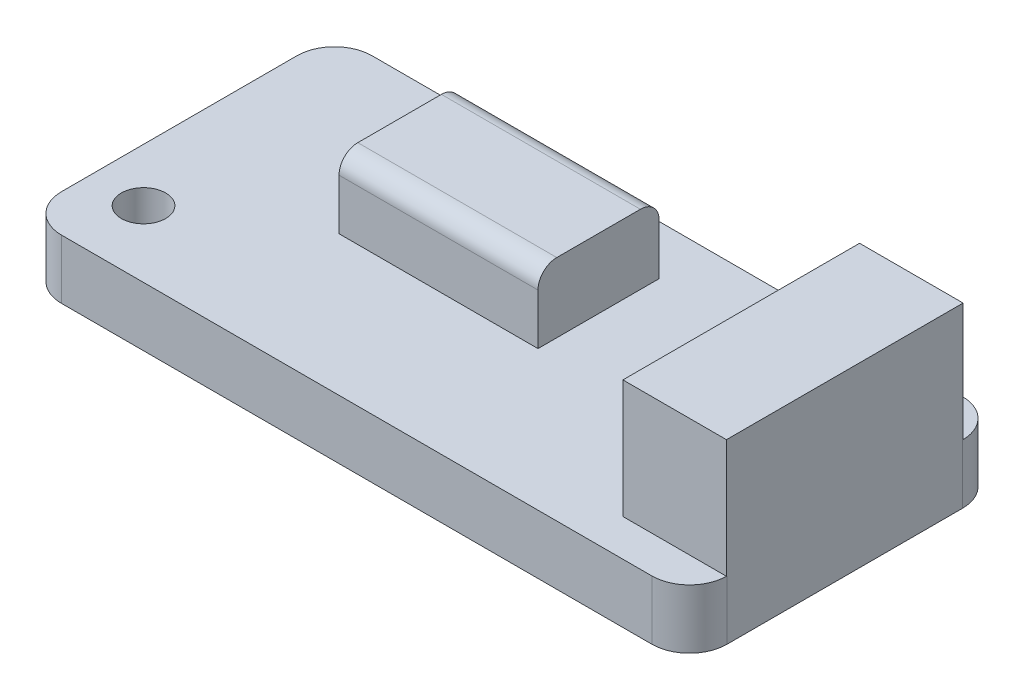
ISO-10303-21;
HEADER;
FILE_DESCRIPTION(('STEP AP214'),'2;1');
FILE_NAME('part.step','',(''),(''),'','','');
FILE_SCHEMA(('AUTOMOTIVE_DESIGN { 1 0 10303 214 1 1 1 1 }'));
ENDSEC;
DATA;
#1=APPLICATION_CONTEXT('core data for automotive mechanical design processes');
#2=APPLICATION_PROTOCOL_DEFINITION('international standard','automotive_design',2000,#1);
#3=PRODUCT_CONTEXT('',#1,'mechanical');
#4=PRODUCT('Part','Part','',(#3));
#5=PRODUCT_RELATED_PRODUCT_CATEGORY('part','',(#4));
#6=PRODUCT_DEFINITION_FORMATION('','',#4);
#7=PRODUCT_DEFINITION_CONTEXT('part definition',#1,'design');
#8=PRODUCT_DEFINITION('design','',#6,#7);
#9=PRODUCT_DEFINITION_SHAPE('','',#8);
#10=(LENGTH_UNIT() NAMED_UNIT(*) SI_UNIT(.MILLI.,.METRE.));
#11=(NAMED_UNIT(*) PLANE_ANGLE_UNIT() SI_UNIT($,.RADIAN.));
#12=(NAMED_UNIT(*) SI_UNIT($,.STERADIAN.) SOLID_ANGLE_UNIT());
#13=UNCERTAINTY_MEASURE_WITH_UNIT(LENGTH_MEASURE(1.E-05),#10,'distance_accuracy_value','');
#14=(GEOMETRIC_REPRESENTATION_CONTEXT(3) GLOBAL_UNCERTAINTY_ASSIGNED_CONTEXT((#13)) GLOBAL_UNIT_ASSIGNED_CONTEXT((#10,
#11,#12)) REPRESENTATION_CONTEXT('',''));
#15=CARTESIAN_POINT('',(0.,0.,0.));
#16=DIRECTION('',(0.,0.,1.));
#17=DIRECTION('',(1.,0.,0.));
#18=AXIS2_PLACEMENT_3D('',#15,#16,#17);
#19=CARTESIAN_POINT('',(19.96,4.,-7.96));
#20=DIRECTION('',(0.,-1.,0.));
#21=DIRECTION('',(0.,0.,-1.));
#22=AXIS2_PLACEMENT_3D('',#19,#20,#21);
#23=PLANE('',#22);
#24=CARTESIAN_POINT('',(-18.902,4.,6.01));
#25=DIRECTION('',(0.,1.,0.));
#26=DIRECTION('',(0.,0.,1.));
#27=AXIS2_PLACEMENT_3D('',#24,#25,#26);
#28=CIRCLE('',#27,1.5);
#29=CARTESIAN_POINT('',(-18.902,4.,7.51));
#30=VERTEX_POINT('',#29);
#31=EDGE_CURVE('E596',#30,#30,#28,.T.);
#32=ORIENTED_EDGE('',*,*,#31,.F.);
#33=EDGE_LOOP('',(#32));
#34=FACE_BOUND('',#33,.T.);
#35=CARTESIAN_POINT('',(10.308,4.,-6.69));
#36=DIRECTION('',(0.,1.,0.));
#37=DIRECTION('',(0.,0.,1.));
#38=AXIS2_PLACEMENT_3D('',#35,#36,#37);
#39=CIRCLE('',#38,1.5);
#40=CARTESIAN_POINT('',(10.308,4.,-5.19));
#41=VERTEX_POINT('',#40);
#42=EDGE_CURVE('E597',#41,#41,#39,.T.);
#43=ORIENTED_EDGE('',*,*,#42,.F.);
#44=EDGE_LOOP('',(#43));
#45=FACE_BOUND('',#44,.T.);
#46=DIRECTION('',(1.,0.,0.));
#47=VECTOR('',#46,1.);
#48=CARTESIAN_POINT('',(15.5,4.,7.99999999999999));
#49=LINE('',#48,#47);
#50=CARTESIAN_POINT('',(15.5,4.,7.99999999999999));
#51=VERTEX_POINT('',#50);
#52=CARTESIAN_POINT('',(22.4996850198401,4.,7.99999999999999));
#53=VERTEX_POINT('',#52);
#54=EDGE_CURVE('E214',#51,#53,#49,.T.);
#55=ORIENTED_EDGE('',*,*,#54,.F.);
#56=DIRECTION('',(0.,0.,1.));
#57=VECTOR('',#56,1.);
#58=CARTESIAN_POINT('',(15.5,4.,7.99999999999999));
#59=LINE('',#58,#57);
#60=CARTESIAN_POINT('',(15.5,4.,-8.00000000000001));
#61=VERTEX_POINT('',#60);
#62=EDGE_CURVE('E227',#61,#51,#59,.T.);
#63=ORIENTED_EDGE('',*,*,#62,.F.);
#64=DIRECTION('',(-1.,0.,0.));
#65=VECTOR('',#64,1.);
#66=CARTESIAN_POINT('',(15.5,4.,-8.00000000000001));
#67=LINE('',#66,#65);
#68=CARTESIAN_POINT('',(22.4996850198401,4.,-8.00000000000001));
#69=VERTEX_POINT('',#68);
#70=EDGE_CURVE('E228',#69,#61,#67,.T.);
#71=ORIENTED_EDGE('',*,*,#70,.F.);
#72=CARTESIAN_POINT('',(19.96,4.,-7.96));
#73=DIRECTION('',(0.,1.,0.));
#74=DIRECTION('',(0.,0.,-1.));
#75=AXIS2_PLACEMENT_3D('',#72,#73,#74);
#76=CIRCLE('',#75,2.54);
#77=CARTESIAN_POINT('',(19.96,4.,-10.5));
#78=VERTEX_POINT('',#77);
#79=EDGE_CURVE('E250',#69,#78,#76,.T.);
#80=ORIENTED_EDGE('',*,*,#79,.T.);
#81=DIRECTION('',(-1.,0.,0.));
#82=VECTOR('',#81,1.);
#83=CARTESIAN_POINT('',(-19.96,4.,-10.5));
#84=LINE('',#83,#82);
#85=CARTESIAN_POINT('',(-19.96,4.,-10.5));
#86=VERTEX_POINT('',#85);
#87=EDGE_CURVE('E249',#78,#86,#84,.T.);
#88=ORIENTED_EDGE('',*,*,#87,.T.);
#89=CARTESIAN_POINT('',(-19.96,4.,-7.96));
#90=DIRECTION('',(0.,1.,0.));
#91=DIRECTION('',(0.,0.,-1.));
#92=AXIS2_PLACEMENT_3D('',#89,#90,#91);
#93=CIRCLE('',#92,2.54);
#94=CARTESIAN_POINT('',(-22.5,4.,-7.95999999999998));
#95=VERTEX_POINT('',#94);
#96=EDGE_CURVE('E252',#86,#95,#93,.T.);
#97=ORIENTED_EDGE('',*,*,#96,.T.);
#98=DIRECTION('',(0.,0.,1.));
#99=VECTOR('',#98,1.);
#100=CARTESIAN_POINT('',(-22.5,4.,7.95999999999998));
#101=LINE('',#100,#99);
#102=CARTESIAN_POINT('',(-22.5,4.,7.95999999999998));
#103=VERTEX_POINT('',#102);
#104=EDGE_CURVE('E254',#95,#103,#101,.T.);
#105=ORIENTED_EDGE('',*,*,#104,.T.);
#106=CARTESIAN_POINT('',(-19.96,4.,7.96));
#107=DIRECTION('',(0.,1.,0.));
#108=DIRECTION('',(0.,0.,-1.));
#109=AXIS2_PLACEMENT_3D('',#106,#107,#108);
#110=CIRCLE('',#109,2.54);
#111=CARTESIAN_POINT('',(-19.96,4.,10.5));
#112=VERTEX_POINT('',#111);
#113=EDGE_CURVE('E256',#103,#112,#110,.T.);
#114=ORIENTED_EDGE('',*,*,#113,.T.);
#115=DIRECTION('',(1.,0.,0.));
#116=VECTOR('',#115,1.);
#117=CARTESIAN_POINT('',(-19.96,4.,10.5));
#118=LINE('',#117,#116);
#119=CARTESIAN_POINT('',(19.96,4.,10.5));
#120=VERTEX_POINT('',#119);
#121=EDGE_CURVE('E258',#112,#120,#118,.T.);
#122=ORIENTED_EDGE('',*,*,#121,.T.);
#123=CARTESIAN_POINT('',(19.96,4.,7.96));
#124=DIRECTION('',(0.,1.,0.));
#125=DIRECTION('',(0.,0.,1.));
#126=AXIS2_PLACEMENT_3D('',#123,#124,#125);
#127=CIRCLE('',#126,2.54);
#128=EDGE_CURVE('E261',#120,#53,#127,.T.);
#129=ORIENTED_EDGE('',*,*,#128,.T.);
#130=EDGE_LOOP('',(#55,#63,#71,#80,#88,#97,#105,#114,#122,#129));
#131=FACE_BOUND('',#130,.T.);
#132=DIRECTION('',(0.,0.,1.));
#133=VECTOR('',#132,1.);
#134=CARTESIAN_POINT('',(-10.654824169029,4.,-7.15417175194482));
#135=LINE('',#134,#133);
#136=CARTESIAN_POINT('',(-10.654824169029,4.,-7.15417175194482));
#137=VERTEX_POINT('',#136);
#138=CARTESIAN_POINT('',(-10.654824169029,4.,1.03949504088089));
#139=VERTEX_POINT('',#138);
#140=EDGE_CURVE('E179',#137,#139,#135,.T.);
#141=ORIENTED_EDGE('',*,*,#140,.F.);
#142=DIRECTION('',(-1.,0.,0.));
#143=VECTOR('',#142,1.);
#144=CARTESIAN_POINT('',(-10.654824169029,4.,-7.15417175194482));
#145=LINE('',#144,#143);
#146=CARTESIAN_POINT('',(2.79746459531176,4.,-7.15417175194482));
#147=VERTEX_POINT('',#146);
#148=EDGE_CURVE('E189',#147,#137,#145,.T.);
#149=ORIENTED_EDGE('',*,*,#148,.F.);
#150=DIRECTION('',(0.,0.,-1.));
#151=VECTOR('',#150,1.);
#152=CARTESIAN_POINT('',(2.79746459531176,4.,-7.15417175194482));
#153=LINE('',#152,#151);
#154=CARTESIAN_POINT('',(2.79746459531176,4.,1.03949504088089));
#155=VERTEX_POINT('',#154);
#156=EDGE_CURVE('E197',#155,#147,#153,.T.);
#157=ORIENTED_EDGE('',*,*,#156,.F.);
#158=DIRECTION('',(1.,0.,0.));
#159=VECTOR('',#158,1.);
#160=CARTESIAN_POINT('',(-10.654824169029,4.,1.03949504088089));
#161=LINE('',#160,#159);
#162=EDGE_CURVE('E192',#139,#155,#161,.T.);
#163=ORIENTED_EDGE('',*,*,#162,.F.);
#164=EDGE_LOOP('',(#141,#149,#157,#163));
#165=FACE_BOUND('',#164,.T.);
#166=ADVANCED_FACE('F44',(#34,#45,#131,#165),#23,.F.);
#167=CARTESIAN_POINT('',(19.96,4.,-7.96));
#168=DIRECTION('',(0.,-1.,0.));
#169=DIRECTION('',(0.,0.,-1.));
#170=AXIS2_PLACEMENT_3D('',#167,#168,#169);
#171=CYLINDRICAL_SURFACE('',#170,2.54);
#172=CARTESIAN_POINT('',(19.96,0.,-7.96));
#173=DIRECTION('',(0.,1.,0.));
#174=DIRECTION('',(0.,0.,-1.));
#175=AXIS2_PLACEMENT_3D('',#172,#173,#174);
#176=CIRCLE('',#175,2.54);
#177=CARTESIAN_POINT('',(22.5,0.,-7.95999999999998));
#178=VERTEX_POINT('',#177);
#179=CARTESIAN_POINT('',(19.96,0.,-10.5));
#180=VERTEX_POINT('',#179);
#181=EDGE_CURVE('E245',#178,#180,#176,.T.);
#182=ORIENTED_EDGE('',*,*,#181,.T.);
#183=DIRECTION('',(0.,-1.,0.));
#184=VECTOR('',#183,1.);
#185=CARTESIAN_POINT('',(19.96,4.,-10.5));
#186=LINE('',#185,#184);
#187=EDGE_CURVE('E301',#78,#180,#186,.T.);
#188=ORIENTED_EDGE('',*,*,#187,.F.);
#189=ORIENTED_EDGE('',*,*,#79,.F.);
#190=CARTESIAN_POINT('',(22.5,4.,-7.95999999999998));
#191=VERTEX_POINT('',#190);
#192=EDGE_CURVE('E246',#191,#69,#76,.T.);
#193=ORIENTED_EDGE('',*,*,#192,.F.);
#194=DIRECTION('',(0.,-1.,0.));
#195=VECTOR('',#194,1.);
#196=CARTESIAN_POINT('',(22.5,4.,-7.95999999999998));
#197=LINE('',#196,#195);
#198=EDGE_CURVE('E264',#191,#178,#197,.T.);
#199=ORIENTED_EDGE('',*,*,#198,.T.);
#200=EDGE_LOOP('',(#182,#188,#189,#193,#199));
#201=FACE_BOUND('',#200,.T.);
#202=ADVANCED_FACE('F334',(#201),#171,.T.);
#203=CARTESIAN_POINT('',(-19.96,4.,-10.5));
#204=DIRECTION('',(0.,0.,1.));
#205=DIRECTION('',(1.,0.,0.));
#206=AXIS2_PLACEMENT_3D('',#203,#204,#205);
#207=PLANE('',#206);
#208=DIRECTION('',(-1.,0.,0.));
#209=VECTOR('',#208,1.);
#210=CARTESIAN_POINT('',(-19.96,0.,-10.5));
#211=LINE('',#210,#209);
#212=CARTESIAN_POINT('',(-19.96,0.,-10.5));
#213=VERTEX_POINT('',#212);
#214=EDGE_CURVE('E267',#180,#213,#211,.T.);
#215=ORIENTED_EDGE('',*,*,#214,.T.);
#216=DIRECTION('',(0.,-1.,0.));
#217=VECTOR('',#216,1.);
#218=CARTESIAN_POINT('',(-19.96,4.,-10.5));
#219=LINE('',#218,#217);
#220=EDGE_CURVE('E298',#86,#213,#219,.T.);
#221=ORIENTED_EDGE('',*,*,#220,.F.);
#222=ORIENTED_EDGE('',*,*,#87,.F.);
#223=ORIENTED_EDGE('',*,*,#187,.T.);
#224=EDGE_LOOP('',(#215,#221,#222,#223));
#225=FACE_BOUND('',#224,.T.);
#226=ADVANCED_FACE('F341',(#225),#207,.F.);
#227=CARTESIAN_POINT('',(-19.96,4.,-7.96));
#228=DIRECTION('',(0.,-1.,0.));
#229=DIRECTION('',(0.,0.,-1.));
#230=AXIS2_PLACEMENT_3D('',#227,#228,#229);
#231=CYLINDRICAL_SURFACE('',#230,2.54);
#232=CARTESIAN_POINT('',(-19.96,0.,-7.96));
#233=DIRECTION('',(0.,1.,0.));
#234=DIRECTION('',(0.,0.,-1.));
#235=AXIS2_PLACEMENT_3D('',#232,#233,#234);
#236=CIRCLE('',#235,2.54);
#237=CARTESIAN_POINT('',(-22.5,0.,-7.95999999999998));
#238=VERTEX_POINT('',#237);
#239=EDGE_CURVE('E269',#213,#238,#236,.T.);
#240=ORIENTED_EDGE('',*,*,#239,.T.);
#241=DIRECTION('',(0.,-1.,0.));
#242=VECTOR('',#241,1.);
#243=CARTESIAN_POINT('',(-22.5,4.,-7.95999999999998));
#244=LINE('',#243,#242);
#245=EDGE_CURVE('E295',#95,#238,#244,.T.);
#246=ORIENTED_EDGE('',*,*,#245,.F.);
#247=ORIENTED_EDGE('',*,*,#96,.F.);
#248=ORIENTED_EDGE('',*,*,#220,.T.);
#249=EDGE_LOOP('',(#240,#246,#247,#248));
#250=FACE_BOUND('',#249,.T.);
#251=ADVANCED_FACE('F372',(#250),#231,.T.);
#252=CARTESIAN_POINT('',(-22.5,4.,7.95999999999998));
#253=DIRECTION('',(1.,0.,0.));
#254=DIRECTION('',(0.,0.,-1.));
#255=AXIS2_PLACEMENT_3D('',#252,#253,#254);
#256=PLANE('',#255);
#257=DIRECTION('',(0.,0.,1.));
#258=VECTOR('',#257,1.);
#259=CARTESIAN_POINT('',(-22.5,0.,7.95999999999998));
#260=LINE('',#259,#258);
#261=CARTESIAN_POINT('',(-22.5,0.,7.95999999999998));
#262=VERTEX_POINT('',#261);
#263=EDGE_CURVE('E271',#238,#262,#260,.T.);
#264=ORIENTED_EDGE('',*,*,#263,.T.);
#265=DIRECTION('',(0.,-1.,0.));
#266=VECTOR('',#265,1.);
#267=CARTESIAN_POINT('',(-22.5,4.,7.95999999999998));
#268=LINE('',#267,#266);
#269=EDGE_CURVE('E292',#103,#262,#268,.T.);
#270=ORIENTED_EDGE('',*,*,#269,.F.);
#271=ORIENTED_EDGE('',*,*,#104,.F.);
#272=ORIENTED_EDGE('',*,*,#245,.T.);
#273=EDGE_LOOP('',(#264,#270,#271,#272));
#274=FACE_BOUND('',#273,.T.);
#275=ADVANCED_FACE('F368',(#274),#256,.F.);
#276=CARTESIAN_POINT('',(-19.96,4.,7.96));
#277=DIRECTION('',(0.,-1.,0.));
#278=DIRECTION('',(0.,0.,-1.));
#279=AXIS2_PLACEMENT_3D('',#276,#277,#278);
#280=CYLINDRICAL_SURFACE('',#279,2.54);
#281=CARTESIAN_POINT('',(-19.96,0.,7.96));
#282=DIRECTION('',(0.,1.,0.));
#283=DIRECTION('',(0.,0.,-1.));
#284=AXIS2_PLACEMENT_3D('',#281,#282,#283);
#285=CIRCLE('',#284,2.54);
#286=CARTESIAN_POINT('',(-19.96,0.,10.5));
#287=VERTEX_POINT('',#286);
#288=EDGE_CURVE('E273',#262,#287,#285,.T.);
#289=ORIENTED_EDGE('',*,*,#288,.T.);
#290=DIRECTION('',(0.,-1.,0.));
#291=VECTOR('',#290,1.);
#292=CARTESIAN_POINT('',(-19.96,4.,10.5));
#293=LINE('',#292,#291);
#294=EDGE_CURVE('E289',#112,#287,#293,.T.);
#295=ORIENTED_EDGE('',*,*,#294,.F.);
#296=ORIENTED_EDGE('',*,*,#113,.F.);
#297=ORIENTED_EDGE('',*,*,#269,.T.);
#298=EDGE_LOOP('',(#289,#295,#296,#297));
#299=FACE_BOUND('',#298,.T.);
#300=ADVANCED_FACE('F364',(#299),#280,.T.);
#301=CARTESIAN_POINT('',(-19.96,4.,10.5));
#302=DIRECTION('',(0.,0.,-1.));
#303=DIRECTION('',(-1.,0.,0.));
#304=AXIS2_PLACEMENT_3D('',#301,#302,#303);
#305=PLANE('',#304);
#306=DIRECTION('',(1.,0.,0.));
#307=VECTOR('',#306,1.);
#308=CARTESIAN_POINT('',(-19.96,0.,10.5));
#309=LINE('',#308,#307);
#310=CARTESIAN_POINT('',(19.96,0.,10.5));
#311=VERTEX_POINT('',#310);
#312=EDGE_CURVE('E275',#287,#311,#309,.T.);
#313=ORIENTED_EDGE('',*,*,#312,.T.);
#314=DIRECTION('',(0.,-1.,0.));
#315=VECTOR('',#314,1.);
#316=CARTESIAN_POINT('',(19.96,4.,10.5));
#317=LINE('',#316,#315);
#318=EDGE_CURVE('E286',#120,#311,#317,.T.);
#319=ORIENTED_EDGE('',*,*,#318,.F.);
#320=ORIENTED_EDGE('',*,*,#121,.F.);
#321=ORIENTED_EDGE('',*,*,#294,.T.);
#322=EDGE_LOOP('',(#313,#319,#320,#321));
#323=FACE_BOUND('',#322,.T.);
#324=ADVANCED_FACE('F360',(#323),#305,.F.);
#325=CARTESIAN_POINT('',(19.96,4.,7.96));
#326=DIRECTION('',(0.,-1.,0.));
#327=DIRECTION('',(0.,0.,-1.));
#328=AXIS2_PLACEMENT_3D('',#325,#326,#327);
#329=CYLINDRICAL_SURFACE('',#328,2.54);
#330=CARTESIAN_POINT('',(19.96,0.,7.96));
#331=DIRECTION('',(0.,1.,0.));
#332=DIRECTION('',(0.,0.,1.));
#333=AXIS2_PLACEMENT_3D('',#330,#331,#332);
#334=CIRCLE('',#333,2.54);
#335=CARTESIAN_POINT('',(22.5,0.,7.95999999999998));
#336=VERTEX_POINT('',#335);
#337=EDGE_CURVE('E277',#311,#336,#334,.T.);
#338=ORIENTED_EDGE('',*,*,#337,.T.);
#339=DIRECTION('',(0.,-1.,0.));
#340=VECTOR('',#339,1.);
#341=CARTESIAN_POINT('',(22.5,4.,7.95999999999998));
#342=LINE('',#341,#340);
#343=CARTESIAN_POINT('',(22.5,4.,7.95999999999998));
#344=VERTEX_POINT('',#343);
#345=EDGE_CURVE('E283',#344,#336,#342,.T.);
#346=ORIENTED_EDGE('',*,*,#345,.F.);
#347=EDGE_CURVE('E260',#53,#344,#127,.T.);
#348=ORIENTED_EDGE('',*,*,#347,.F.);
#349=ORIENTED_EDGE('',*,*,#128,.F.);
#350=ORIENTED_EDGE('',*,*,#318,.T.);
#351=EDGE_LOOP('',(#338,#346,#348,#349,#350));
#352=FACE_BOUND('',#351,.T.);
#353=ADVANCED_FACE('F356',(#352),#329,.T.);
#354=CARTESIAN_POINT('',(22.5,4.,7.95999999999998));
#355=DIRECTION('',(-1.,0.,0.));
#356=DIRECTION('',(0.,0.,1.));
#357=AXIS2_PLACEMENT_3D('',#354,#355,#356);
#358=PLANE('',#357);
#359=DIRECTION('',(0.,0.,-1.));
#360=VECTOR('',#359,1.);
#361=CARTESIAN_POINT('',(22.5,0.,7.95999999999998));
#362=LINE('',#361,#360);
#363=EDGE_CURVE('E279',#336,#178,#362,.T.);
#364=ORIENTED_EDGE('',*,*,#363,.T.);
#365=ORIENTED_EDGE('',*,*,#198,.F.);
#366=DIRECTION('',(0.,0.,-1.));
#367=VECTOR('',#366,1.);
#368=CARTESIAN_POINT('',(22.5,4.,7.99999999999999));
#369=LINE('',#368,#367);
#370=CARTESIAN_POINT('',(22.5,4.,-8.00000000000001));
#371=VERTEX_POINT('',#370);
#372=EDGE_CURVE('E209',#191,#371,#369,.T.);
#373=ORIENTED_EDGE('',*,*,#372,.T.);
#374=DIRECTION('',(0.,-1.,0.));
#375=VECTOR('',#374,1.);
#376=CARTESIAN_POINT('',(22.5,12.,-8.00000000000001));
#377=LINE('',#376,#375);
#378=CARTESIAN_POINT('',(22.5,12.,-8.00000000000001));
#379=VERTEX_POINT('',#378);
#380=EDGE_CURVE('E242',#379,#371,#377,.T.);
#381=ORIENTED_EDGE('',*,*,#380,.F.);
#382=DIRECTION('',(0.,0.,-1.));
#383=VECTOR('',#382,1.);
#384=CARTESIAN_POINT('',(22.5,12.,7.99999999999999));
#385=LINE('',#384,#383);
#386=CARTESIAN_POINT('',(22.5,12.,7.99999999999999));
#387=VERTEX_POINT('',#386);
#388=EDGE_CURVE('E210',#387,#379,#385,.T.);
#389=ORIENTED_EDGE('',*,*,#388,.F.);
#390=DIRECTION('',(0.,-1.,0.));
#391=VECTOR('',#390,1.);
#392=CARTESIAN_POINT('',(22.5,12.,7.99999999999999));
#393=LINE('',#392,#391);
#394=CARTESIAN_POINT('',(22.5,4.,7.99999999999999));
#395=VERTEX_POINT('',#394);
#396=EDGE_CURVE('E220',#387,#395,#393,.T.);
#397=ORIENTED_EDGE('',*,*,#396,.T.);
#398=EDGE_CURVE('E221',#395,#344,#369,.T.);
#399=ORIENTED_EDGE('',*,*,#398,.T.);
#400=ORIENTED_EDGE('',*,*,#345,.T.);
#401=EDGE_LOOP('',(#364,#365,#373,#381,#389,#397,#399,#400));
#402=FACE_BOUND('',#401,.T.);
#403=ADVANCED_FACE('F352',(#402),#358,.F.);
#404=CARTESIAN_POINT('',(19.96,0.,-7.96));
#405=DIRECTION('',(0.,-1.,0.));
#406=DIRECTION('',(0.,0.,-1.));
#407=AXIS2_PLACEMENT_3D('',#404,#405,#406);
#408=PLANE('',#407);
#409=CARTESIAN_POINT('',(-18.902,0.,6.01));
#410=DIRECTION('',(0.,1.,0.));
#411=DIRECTION('',(0.,0.,1.));
#412=AXIS2_PLACEMENT_3D('',#409,#410,#411);
#413=CIRCLE('',#412,1.5);
#414=CARTESIAN_POINT('',(-18.902,0.,7.51));
#415=VERTEX_POINT('',#414);
#416=EDGE_CURVE('E193',#415,#415,#413,.T.);
#417=ORIENTED_EDGE('',*,*,#416,.T.);
#418=EDGE_LOOP('',(#417));
#419=FACE_BOUND('',#418,.T.);
#420=CARTESIAN_POINT('',(10.308,0.,-6.69));
#421=DIRECTION('',(0.,1.,0.));
#422=DIRECTION('',(0.,0.,1.));
#423=AXIS2_PLACEMENT_3D('',#420,#421,#422);
#424=CIRCLE('',#423,1.5);
#425=CARTESIAN_POINT('',(10.308,0.,-5.19));
#426=VERTEX_POINT('',#425);
#427=EDGE_CURVE('E601',#426,#426,#424,.T.);
#428=ORIENTED_EDGE('',*,*,#427,.T.);
#429=EDGE_LOOP('',(#428));
#430=FACE_BOUND('',#429,.T.);
#431=ORIENTED_EDGE('',*,*,#181,.F.);
#432=ORIENTED_EDGE('',*,*,#363,.F.);
#433=ORIENTED_EDGE('',*,*,#337,.F.);
#434=ORIENTED_EDGE('',*,*,#312,.F.);
#435=ORIENTED_EDGE('',*,*,#288,.F.);
#436=ORIENTED_EDGE('',*,*,#263,.F.);
#437=ORIENTED_EDGE('',*,*,#239,.F.);
#438=ORIENTED_EDGE('',*,*,#214,.F.);
#439=EDGE_LOOP('',(#431,#432,#433,#434,#435,#436,#437,#438));
#440=FACE_BOUND('',#439,.T.);
#441=ADVANCED_FACE('F349',(#419,#430,#440),#408,.T.);
#442=CARTESIAN_POINT('',(0.,4.,0.));
#443=DIRECTION('',(0.,-1.,0.));
#444=DIRECTION('',(0.,0.,-1.));
#445=AXIS2_PLACEMENT_3D('',#442,#443,#444);
#446=PLANE('',#445);
#447=ORIENTED_EDGE('',*,*,#372,.F.);
#448=ORIENTED_EDGE('',*,*,#192,.T.);
#449=EDGE_CURVE('E224',#371,#69,#67,.T.);
#450=ORIENTED_EDGE('',*,*,#449,.F.);
#451=EDGE_LOOP('',(#447,#448,#450));
#452=FACE_BOUND('',#451,.T.);
#453=ADVANCED_FACE('F351',(#452),#446,.T.);
#454=CARTESIAN_POINT('',(15.5,12.,-8.00000000000001));
#455=DIRECTION('',(0.,0.,1.));
#456=DIRECTION('',(1.,0.,0.));
#457=AXIS2_PLACEMENT_3D('',#454,#455,#456);
#458=PLANE('',#457);
#459=ORIENTED_EDGE('',*,*,#449,.T.);
#460=ORIENTED_EDGE('',*,*,#70,.T.);
#461=DIRECTION('',(0.,-1.,0.));
#462=VECTOR('',#461,1.);
#463=CARTESIAN_POINT('',(15.5,12.,-8.00000000000001));
#464=LINE('',#463,#462);
#465=CARTESIAN_POINT('',(15.5,12.,-8.00000000000001));
#466=VERTEX_POINT('',#465);
#467=EDGE_CURVE('E239',#466,#61,#464,.T.);
#468=ORIENTED_EDGE('',*,*,#467,.F.);
#469=DIRECTION('',(-1.,0.,0.));
#470=VECTOR('',#469,1.);
#471=CARTESIAN_POINT('',(15.5,12.,-8.00000000000001));
#472=LINE('',#471,#470);
#473=EDGE_CURVE('E213',#379,#466,#472,.T.);
#474=ORIENTED_EDGE('',*,*,#473,.F.);
#475=ORIENTED_EDGE('',*,*,#380,.T.);
#476=EDGE_LOOP('',(#459,#460,#468,#474,#475));
#477=FACE_BOUND('',#476,.T.);
#478=ADVANCED_FACE('F347',(#477),#458,.F.);
#479=CARTESIAN_POINT('',(15.5,12.,7.99999999999999));
#480=DIRECTION('',(1.,0.,0.));
#481=DIRECTION('',(0.,0.,-1.));
#482=AXIS2_PLACEMENT_3D('',#479,#480,#481);
#483=PLANE('',#482);
#484=ORIENTED_EDGE('',*,*,#62,.T.);
#485=DIRECTION('',(0.,-1.,0.));
#486=VECTOR('',#485,1.);
#487=CARTESIAN_POINT('',(15.5,12.,7.99999999999999));
#488=LINE('',#487,#486);
#489=CARTESIAN_POINT('',(15.5,12.,7.99999999999999));
#490=VERTEX_POINT('',#489);
#491=EDGE_CURVE('E236',#490,#51,#488,.T.);
#492=ORIENTED_EDGE('',*,*,#491,.F.);
#493=DIRECTION('',(0.,0.,1.));
#494=VECTOR('',#493,1.);
#495=CARTESIAN_POINT('',(15.5,12.,7.99999999999999));
#496=LINE('',#495,#494);
#497=EDGE_CURVE('E216',#466,#490,#496,.T.);
#498=ORIENTED_EDGE('',*,*,#497,.F.);
#499=ORIENTED_EDGE('',*,*,#467,.T.);
#500=EDGE_LOOP('',(#484,#492,#498,#499));
#501=FACE_BOUND('',#500,.T.);
#502=ADVANCED_FACE('F416',(#501),#483,.F.);
#503=CARTESIAN_POINT('',(15.5,12.,7.99999999999999));
#504=DIRECTION('',(0.,0.,-1.));
#505=DIRECTION('',(-1.,0.,0.));
#506=AXIS2_PLACEMENT_3D('',#503,#504,#505);
#507=PLANE('',#506);
#508=ORIENTED_EDGE('',*,*,#54,.T.);
#509=EDGE_CURVE('E231',#53,#395,#49,.T.);
#510=ORIENTED_EDGE('',*,*,#509,.T.);
#511=ORIENTED_EDGE('',*,*,#396,.F.);
#512=DIRECTION('',(1.,0.,0.));
#513=VECTOR('',#512,1.);
#514=CARTESIAN_POINT('',(15.5,12.,7.99999999999999));
#515=LINE('',#514,#513);
#516=EDGE_CURVE('E218',#490,#387,#515,.T.);
#517=ORIENTED_EDGE('',*,*,#516,.F.);
#518=ORIENTED_EDGE('',*,*,#491,.T.);
#519=EDGE_LOOP('',(#508,#510,#511,#517,#518));
#520=FACE_BOUND('',#519,.T.);
#521=ADVANCED_FACE('F411',(#520),#507,.F.);
#522=CARTESIAN_POINT('',(0.,12.,0.));
#523=DIRECTION('',(0.,-1.,0.));
#524=DIRECTION('',(0.,0.,-1.));
#525=AXIS2_PLACEMENT_3D('',#522,#523,#524);
#526=PLANE('',#525);
#527=ORIENTED_EDGE('',*,*,#388,.T.);
#528=ORIENTED_EDGE('',*,*,#473,.T.);
#529=ORIENTED_EDGE('',*,*,#497,.T.);
#530=ORIENTED_EDGE('',*,*,#516,.T.);
#531=EDGE_LOOP('',(#527,#528,#529,#530));
#532=FACE_BOUND('',#531,.T.);
#533=ADVANCED_FACE('F426',(#532),#526,.F.);
#534=ORIENTED_EDGE('',*,*,#509,.F.);
#535=ORIENTED_EDGE('',*,*,#347,.T.);
#536=ORIENTED_EDGE('',*,*,#398,.F.);
#537=EDGE_LOOP('',(#534,#535,#536));
#538=FACE_BOUND('',#537,.T.);
#539=ADVANCED_FACE('F408',(#538),#446,.T.);
#540=CARTESIAN_POINT('',(-10.654824169029,8.698,-7.15417175194482));
#541=DIRECTION('',(1.,0.,0.));
#542=DIRECTION('',(0.,0.,-1.));
#543=AXIS2_PLACEMENT_3D('',#540,#541,#542);
#544=PLANE('',#543);
#545=DIRECTION('',(0.,0.,1.));
#546=VECTOR('',#545,1.);
#547=CARTESIAN_POINT('',(-10.654824169029,8.698,-7.15417175194482));
#548=LINE('',#547,#546);
#549=CARTESIAN_POINT('',(-10.654824169029,8.698,-5.88417175194482));
#550=VERTEX_POINT('',#549);
#551=CARTESIAN_POINT('',(-10.654824169029,8.698,-0.23050495911911));
#552=VERTEX_POINT('',#551);
#553=EDGE_CURVE('E196',#550,#552,#548,.T.);
#554=ORIENTED_EDGE('',*,*,#553,.F.);
#555=CARTESIAN_POINT('',(-10.654824169029,7.428,-5.88417175194482));
#556=DIRECTION('',(1.,0.,0.));
#557=DIRECTION('',(0.,0.,-1.));
#558=AXIS2_PLACEMENT_3D('',#555,#556,#557);
#559=CIRCLE('',#558,1.27);
#560=CARTESIAN_POINT('',(-10.654824169029,7.428,-7.15417175194482));
#561=VERTEX_POINT('',#560);
#562=EDGE_CURVE('E180',#550,#561,#559,.F.);
#563=ORIENTED_EDGE('',*,*,#562,.T.);
#564=DIRECTION('',(0.,-1.,0.));
#565=VECTOR('',#564,1.);
#566=CARTESIAN_POINT('',(-10.654824169029,8.698,-7.15417175194482));
#567=LINE('',#566,#565);
#568=EDGE_CURVE('E174',#561,#137,#567,.T.);
#569=ORIENTED_EDGE('',*,*,#568,.T.);
#570=ORIENTED_EDGE('',*,*,#140,.T.);
#571=DIRECTION('',(0.,-1.,0.));
#572=VECTOR('',#571,1.);
#573=CARTESIAN_POINT('',(-10.654824169029,8.698,1.03949504088089));
#574=LINE('',#573,#572);
#575=CARTESIAN_POINT('',(-10.654824169029,7.428,1.03949504088089));
#576=VERTEX_POINT('',#575);
#577=EDGE_CURVE('E207',#576,#139,#574,.T.);
#578=ORIENTED_EDGE('',*,*,#577,.F.);
#579=CARTESIAN_POINT('',(-10.654824169029,7.428,-0.23050495911911));
#580=DIRECTION('',(1.,0.,0.));
#581=DIRECTION('',(0.,0.,-1.));
#582=AXIS2_PLACEMENT_3D('',#579,#580,#581);
#583=CIRCLE('',#582,1.27);
#584=EDGE_CURVE('E310',#576,#552,#583,.F.);
#585=ORIENTED_EDGE('',*,*,#584,.T.);
#586=EDGE_LOOP('',(#554,#563,#569,#570,#578,#585));
#587=FACE_BOUND('',#586,.T.);
#588=ADVANCED_FACE('F177',(#587),#544,.F.);
#589=CARTESIAN_POINT('',(-10.654824169029,8.698,1.03949504088089));
#590=DIRECTION('',(0.,0.,-1.));
#591=DIRECTION('',(-1.,0.,0.));
#592=AXIS2_PLACEMENT_3D('',#589,#590,#591);
#593=PLANE('',#592);
#594=DIRECTION('',(0.,-1.,0.));
#595=VECTOR('',#594,1.);
#596=CARTESIAN_POINT('',(2.79746459531176,8.698,1.03949504088089));
#597=LINE('',#596,#595);
#598=CARTESIAN_POINT('',(2.79746459531176,7.428,1.03949504088089));
#599=VERTEX_POINT('',#598);
#600=EDGE_CURVE('E205',#599,#155,#597,.T.);
#601=ORIENTED_EDGE('',*,*,#600,.F.);
#602=DIRECTION('',(1.,0.,0.));
#603=VECTOR('',#602,1.);
#604=CARTESIAN_POINT('',(-10.654824169029,7.428,1.03949504088089));
#605=LINE('',#604,#603);
#606=EDGE_CURVE('E11',#599,#576,#605,.F.);
#607=ORIENTED_EDGE('',*,*,#606,.T.);
#608=ORIENTED_EDGE('',*,*,#577,.T.);
#609=ORIENTED_EDGE('',*,*,#162,.T.);
#610=EDGE_LOOP('',(#601,#607,#608,#609));
#611=FACE_BOUND('',#610,.T.);
#612=ADVANCED_FACE('F535',(#611),#593,.F.);
#613=CARTESIAN_POINT('',(2.79746459531176,8.698,-7.15417175194482));
#614=DIRECTION('',(-1.,0.,0.));
#615=DIRECTION('',(0.,0.,1.));
#616=AXIS2_PLACEMENT_3D('',#613,#614,#615);
#617=PLANE('',#616);
#618=DIRECTION('',(0.,-1.,0.));
#619=VECTOR('',#618,1.);
#620=CARTESIAN_POINT('',(2.79746459531176,8.698,-7.15417175194482));
#621=LINE('',#620,#619);
#622=CARTESIAN_POINT('',(2.79746459531176,7.428,-7.15417175194482));
#623=VERTEX_POINT('',#622);
#624=EDGE_CURVE('E182',#623,#147,#621,.T.);
#625=ORIENTED_EDGE('',*,*,#624,.F.);
#626=CARTESIAN_POINT('',(2.79746459531176,7.428,-5.88417175194482));
#627=DIRECTION('',(-1.,0.,0.));
#628=DIRECTION('',(0.,0.,1.));
#629=AXIS2_PLACEMENT_3D('',#626,#627,#628);
#630=CIRCLE('',#629,1.27);
#631=CARTESIAN_POINT('',(2.79746459531176,8.698,-5.88417175194482));
#632=VERTEX_POINT('',#631);
#633=EDGE_CURVE('E52',#623,#632,#630,.F.);
#634=ORIENTED_EDGE('',*,*,#633,.T.);
#635=DIRECTION('',(0.,0.,-1.));
#636=VECTOR('',#635,1.);
#637=CARTESIAN_POINT('',(2.79746459531176,8.698,-7.15417175194482));
#638=LINE('',#637,#636);
#639=CARTESIAN_POINT('',(2.79746459531176,8.698,-0.23050495911911));
#640=VERTEX_POINT('',#639);
#641=EDGE_CURVE('E183',#640,#632,#638,.T.);
#642=ORIENTED_EDGE('',*,*,#641,.F.);
#643=CARTESIAN_POINT('',(2.79746459531176,7.428,-0.23050495911911));
#644=DIRECTION('',(-1.,0.,0.));
#645=DIRECTION('',(0.,0.,1.));
#646=AXIS2_PLACEMENT_3D('',#643,#644,#645);
#647=CIRCLE('',#646,1.27);
#648=EDGE_CURVE('E59',#640,#599,#647,.F.);
#649=ORIENTED_EDGE('',*,*,#648,.T.);
#650=ORIENTED_EDGE('',*,*,#600,.T.);
#651=ORIENTED_EDGE('',*,*,#156,.T.);
#652=EDGE_LOOP('',(#625,#634,#642,#649,#650,#651));
#653=FACE_BOUND('',#652,.T.);
#654=ADVANCED_FACE('F316',(#653),#617,.F.);
#655=CARTESIAN_POINT('',(-10.654824169029,8.698,-7.15417175194482));
#656=DIRECTION('',(0.,0.,1.));
#657=DIRECTION('',(1.,0.,0.));
#658=AXIS2_PLACEMENT_3D('',#655,#656,#657);
#659=PLANE('',#658);
#660=ORIENTED_EDGE('',*,*,#568,.F.);
#661=DIRECTION('',(-1.,0.,0.));
#662=VECTOR('',#661,1.);
#663=CARTESIAN_POINT('',(2.79746459531176,7.428,-7.15417175194482));
#664=LINE('',#663,#662);
#665=EDGE_CURVE('E67',#561,#623,#664,.F.);
#666=ORIENTED_EDGE('',*,*,#665,.T.);
#667=ORIENTED_EDGE('',*,*,#624,.T.);
#668=ORIENTED_EDGE('',*,*,#148,.T.);
#669=EDGE_LOOP('',(#660,#666,#667,#668));
#670=FACE_BOUND('',#669,.T.);
#671=ADVANCED_FACE('F195',(#670),#659,.F.);
#672=CARTESIAN_POINT('',(0.,8.698,0.));
#673=DIRECTION('',(0.,1.,0.));
#674=DIRECTION('',(0.,0.,1.));
#675=AXIS2_PLACEMENT_3D('',#672,#673,#674);
#676=PLANE('',#675);
#677=ORIENTED_EDGE('',*,*,#641,.T.);
#678=DIRECTION('',(-1.,0.,0.));
#679=VECTOR('',#678,1.);
#680=CARTESIAN_POINT('',(-10.654824169029,8.698,-5.88417175194482));
#681=LINE('',#680,#679);
#682=EDGE_CURVE('E307',#632,#550,#681,.T.);
#683=ORIENTED_EDGE('',*,*,#682,.T.);
#684=ORIENTED_EDGE('',*,*,#553,.T.);
#685=DIRECTION('',(1.,0.,0.));
#686=VECTOR('',#685,1.);
#687=CARTESIAN_POINT('',(2.79746459531176,8.698,-0.23050495911911));
#688=LINE('',#687,#686);
#689=EDGE_CURVE('E304',#552,#640,#688,.T.);
#690=ORIENTED_EDGE('',*,*,#689,.T.);
#691=EDGE_LOOP('',(#677,#683,#684,#690));
#692=FACE_BOUND('',#691,.T.);
#693=ADVANCED_FACE('F320',(#692),#676,.T.);
#694=CARTESIAN_POINT('',(0.,7.428,-5.88417175194482));
#695=DIRECTION('',(1.,0.,0.));
#696=DIRECTION('',(0.,0.,-1.));
#697=AXIS2_PLACEMENT_3D('',#694,#695,#696);
#698=CYLINDRICAL_SURFACE('',#697,1.27);
#699=ORIENTED_EDGE('',*,*,#633,.F.);
#700=ORIENTED_EDGE('',*,*,#665,.F.);
#701=ORIENTED_EDGE('',*,*,#562,.F.);
#702=ORIENTED_EDGE('',*,*,#682,.F.);
#703=EDGE_LOOP('',(#699,#700,#701,#702));
#704=FACE_BOUND('',#703,.T.);
#705=ADVANCED_FACE('F323',(#704),#698,.T.);
#706=CARTESIAN_POINT('',(0.,7.428,-0.23050495911911));
#707=DIRECTION('',(-1.,0.,0.));
#708=DIRECTION('',(0.,0.,1.));
#709=AXIS2_PLACEMENT_3D('',#706,#707,#708);
#710=CYLINDRICAL_SURFACE('',#709,1.27);
#711=ORIENTED_EDGE('',*,*,#584,.F.);
#712=ORIENTED_EDGE('',*,*,#606,.F.);
#713=ORIENTED_EDGE('',*,*,#648,.F.);
#714=ORIENTED_EDGE('',*,*,#689,.F.);
#715=EDGE_LOOP('',(#711,#712,#713,#714));
#716=FACE_BOUND('',#715,.T.);
#717=ADVANCED_FACE('F46',(#716),#710,.T.);
#718=CARTESIAN_POINT('',(10.308,0.,-6.69));
#719=DIRECTION('',(0.,1.,0.));
#720=DIRECTION('',(0.,0.,1.));
#721=AXIS2_PLACEMENT_3D('',#718,#719,#720);
#722=CYLINDRICAL_SURFACE('',#721,1.5);
#723=ORIENTED_EDGE('',*,*,#427,.F.);
#724=EDGE_LOOP('',(#723));
#725=FACE_BOUND('',#724,.T.);
#726=ORIENTED_EDGE('',*,*,#42,.T.);
#727=EDGE_LOOP('',(#726));
#728=FACE_BOUND('',#727,.T.);
#729=ADVANCED_FACE('F329',(#725,#728),#722,.F.);
#730=CARTESIAN_POINT('',(-18.902,0.,6.01));
#731=DIRECTION('',(0.,1.,0.));
#732=DIRECTION('',(0.,0.,1.));
#733=AXIS2_PLACEMENT_3D('',#730,#731,#732);
#734=CYLINDRICAL_SURFACE('',#733,1.5);
#735=ORIENTED_EDGE('',*,*,#416,.F.);
#736=EDGE_LOOP('',(#735));
#737=FACE_BOUND('',#736,.T.);
#738=ORIENTED_EDGE('',*,*,#31,.T.);
#739=EDGE_LOOP('',(#738));
#740=FACE_BOUND('',#739,.T.);
#741=ADVANCED_FACE('F577',(#737,#740),#734,.F.);
#742=CLOSED_SHELL('',(#166,#202,#226,#251,#275,#300,#324,#353,#403,#441,#453,#478,#502,#521,
#533,#539,#588,#612,#654,#671,#693,#705,#717,#729,#741));
#743=MANIFOLD_SOLID_BREP('B2',#742);
#744=ADVANCED_BREP_SHAPE_REPRESENTATION('',(#18,#743),#14);
#745=SHAPE_DEFINITION_REPRESENTATION(#9,#744);
ENDSEC;
END-ISO-10303-21;
